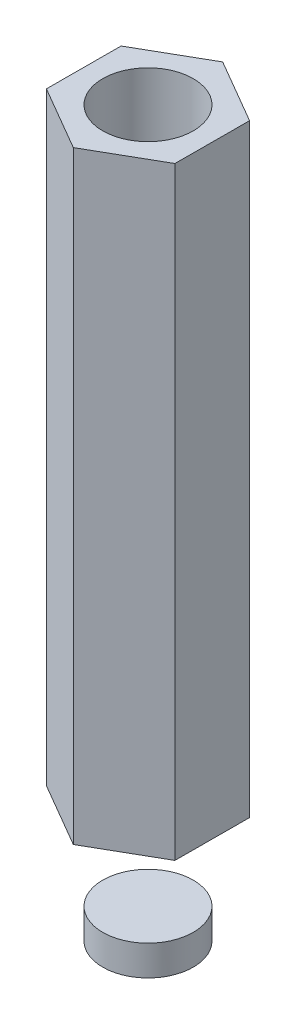
ISO-10303-21;
HEADER;
FILE_DESCRIPTION(('STEP AP214'),'2;1');
FILE_NAME('part.step','',(''),(''),'','','');
FILE_SCHEMA(('AUTOMOTIVE_DESIGN { 1 0 10303 214 1 1 1 1 }'));
ENDSEC;
DATA;
#1=APPLICATION_CONTEXT('core data for automotive mechanical design processes');
#2=APPLICATION_PROTOCOL_DEFINITION('international standard','automotive_design',2000,#1);
#3=PRODUCT_CONTEXT('',#1,'mechanical');
#4=PRODUCT('Part','Part','',(#3));
#5=PRODUCT_RELATED_PRODUCT_CATEGORY('part','',(#4));
#6=PRODUCT_DEFINITION_FORMATION('','',#4);
#7=PRODUCT_DEFINITION_CONTEXT('part definition',#1,'design');
#8=PRODUCT_DEFINITION('design','',#6,#7);
#9=PRODUCT_DEFINITION_SHAPE('','',#8);
#10=(LENGTH_UNIT() NAMED_UNIT(*) SI_UNIT(.MILLI.,.METRE.));
#11=(NAMED_UNIT(*) PLANE_ANGLE_UNIT() SI_UNIT($,.RADIAN.));
#12=(NAMED_UNIT(*) SI_UNIT($,.STERADIAN.) SOLID_ANGLE_UNIT());
#13=UNCERTAINTY_MEASURE_WITH_UNIT(LENGTH_MEASURE(1.E-05),#10,'distance_accuracy_value','');
#14=(GEOMETRIC_REPRESENTATION_CONTEXT(3) GLOBAL_UNCERTAINTY_ASSIGNED_CONTEXT((#13)) GLOBAL_UNIT_ASSIGNED_CONTEXT((#10,
#11,#12)) REPRESENTATION_CONTEXT('',''));
#15=CARTESIAN_POINT('',(0.,0.,0.));
#16=DIRECTION('',(0.,0.,1.));
#17=DIRECTION('',(1.,0.,0.));
#18=AXIS2_PLACEMENT_3D('',#15,#16,#17);
#19=CARTESIAN_POINT('',(0.,1.,0.));
#20=DIRECTION('',(0.,1.,0.));
#21=DIRECTION('',(-1.,0.,0.));
#22=AXIS2_PLACEMENT_3D('',#19,#20,#21);
#23=PLANE('',#22);
#24=CARTESIAN_POINT('',(0.,1.,0.));
#25=DIRECTION('',(0.,1.,0.));
#26=DIRECTION('',(-1.,0.,0.));
#27=AXIS2_PLACEMENT_3D('',#24,#25,#26);
#28=CIRCLE('',#27,1.5);
#29=CARTESIAN_POINT('',(-1.5,0.999999999999999,0.));
#30=VERTEX_POINT('',#29);
#31=EDGE_CURVE('E41',#30,#30,#28,.T.);
#32=ORIENTED_EDGE('',*,*,#31,.T.);
#33=EDGE_LOOP('',(#32));
#34=FACE_BOUND('',#33,.T.);
#35=ADVANCED_FACE('F38',(#34),#23,.T.);
#36=CARTESIAN_POINT('',(0.,0.,0.));
#37=DIRECTION('',(0.,1.,0.));
#38=DIRECTION('',(0.,0.,1.));
#39=AXIS2_PLACEMENT_3D('',#36,#37,#38);
#40=PLANE('',#39);
#41=CARTESIAN_POINT('',(0.,0.,0.));
#42=DIRECTION('',(0.,1.,0.));
#43=DIRECTION('',(0.,0.,1.));
#44=AXIS2_PLACEMENT_3D('',#41,#42,#43);
#45=CIRCLE('',#44,1.5);
#46=CARTESIAN_POINT('',(0.,0.,1.5));
#47=VERTEX_POINT('',#46);
#48=EDGE_CURVE('E11',#47,#47,#45,.T.);
#49=ORIENTED_EDGE('',*,*,#48,.F.);
#50=EDGE_LOOP('',(#49));
#51=FACE_BOUND('',#50,.T.);
#52=ADVANCED_FACE('F53',(#51),#40,.F.);
#53=CARTESIAN_POINT('',(0.,4.,0.));
#54=DIRECTION('',(0.,-1.,0.));
#55=DIRECTION('',(0.,0.,-1.));
#56=AXIS2_PLACEMENT_3D('',#53,#54,#55);
#57=CYLINDRICAL_SURFACE('',#56,1.5);
#58=ORIENTED_EDGE('',*,*,#48,.T.);
#59=EDGE_LOOP('',(#58));
#60=FACE_BOUND('',#59,.T.);
#61=ORIENTED_EDGE('',*,*,#31,.F.);
#62=EDGE_LOOP('',(#61));
#63=FACE_BOUND('',#62,.T.);
#64=ADVANCED_FACE('F51',(#60,#63),#57,.T.);
#65=CLOSED_SHELL('',(#35,#52,#64));
#66=MANIFOLD_SOLID_BREP('B2',#65);
#67=CARTESIAN_POINT('',(-2.13186599078324,4.,-1.24023650407198));
#68=DIRECTION('',(0.,1.,0.));
#69=DIRECTION('',(0.,0.,1.));
#70=AXIS2_PLACEMENT_3D('',#67,#68,#69);
#71=PLANE('',#70);
#72=DIRECTION('',(-0.867671547723485,0.,0.497137893618191));
#73=VECTOR('',#72,1.);
#74=CARTESIAN_POINT('',(0.00814332383552204,4.,-2.46636835751836));
#75=LINE('',#74,#73);
#76=CARTESIAN_POINT('',(0.00814332383552204,4.,-2.46636835751836));
#77=VERTEX_POINT('',#76);
#78=CARTESIAN_POINT('',(-2.13186599078324,4.,-1.24023650407198));
#79=VERTEX_POINT('',#78);
#80=EDGE_CURVE('E163',#77,#79,#75,.T.);
#81=ORIENTED_EDGE('',*,*,#80,.F.);
#82=DIRECTION('',(-0.864369818918982,0.,-0.502856655660404));
#83=VECTOR('',#82,1.);
#84=CARTESIAN_POINT('',(2.14000931461876,4.,-1.22613185344637));
#85=LINE('',#84,#83);
#86=CARTESIAN_POINT('',(2.14000931461876,4.,-1.22613185344637));
#87=VERTEX_POINT('',#86);
#88=EDGE_CURVE('E124',#87,#77,#85,.T.);
#89=ORIENTED_EDGE('',*,*,#88,.F.);
#90=DIRECTION('',(0.00330172880450263,0.,-0.999994549278596));
#91=VECTOR('',#90,1.);
#92=CARTESIAN_POINT('',(2.13186599078323,4.,1.24023650407198));
#93=LINE('',#92,#91);
#94=CARTESIAN_POINT('',(2.13186599078323,4.,1.24023650407198));
#95=VERTEX_POINT('',#94);
#96=EDGE_CURVE('E118',#95,#87,#93,.T.);
#97=ORIENTED_EDGE('',*,*,#96,.F.);
#98=DIRECTION('',(0.867671547723485,0.,-0.497137893618191));
#99=VECTOR('',#98,1.);
#100=CARTESIAN_POINT('',(-0.00814332383552226,4.,2.46636835751835));
#101=LINE('',#100,#99);
#102=CARTESIAN_POINT('',(-0.00814332383552226,4.,2.46636835751835));
#103=VERTEX_POINT('',#102);
#104=EDGE_CURVE('E153',#103,#95,#101,.T.);
#105=ORIENTED_EDGE('',*,*,#104,.F.);
#106=DIRECTION('',(0.864369818918982,0.,0.502856655660404));
#107=VECTOR('',#106,1.);
#108=CARTESIAN_POINT('',(-2.14000931461876,4.,1.22613185344637));
#109=LINE('',#108,#107);
#110=CARTESIAN_POINT('',(-2.14000931461876,4.,1.22613185344637));
#111=VERTEX_POINT('',#110);
#112=EDGE_CURVE('E169',#111,#103,#109,.T.);
#113=ORIENTED_EDGE('',*,*,#112,.F.);
#114=DIRECTION('',(-0.0033017288045028,0.,0.999994549278596));
#115=VECTOR('',#114,1.);
#116=CARTESIAN_POINT('',(-2.13186599078324,4.,-1.24023650407198));
#117=LINE('',#116,#115);
#118=EDGE_CURVE('E166',#79,#111,#117,.T.);
#119=ORIENTED_EDGE('',*,*,#118,.F.);
#120=EDGE_LOOP('',(#81,#89,#97,#105,#113,#119));
#121=FACE_BOUND('',#120,.T.);
#122=ADVANCED_FACE('F78',(#121),#71,.F.);
#123=CARTESIAN_POINT('',(0.00814332383552204,24.,-2.46636835751836));
#124=DIRECTION('',(0.497137893618191,0.,0.867671547723485));
#125=DIRECTION('',(0.867671547723485,0.,-0.497137893618191));
#126=AXIS2_PLACEMENT_3D('',#123,#124,#125);
#127=PLANE('',#126);
#128=ORIENTED_EDGE('',*,*,#80,.T.);
#129=DIRECTION('',(0.,-1.,0.));
#130=VECTOR('',#129,1.);
#131=CARTESIAN_POINT('',(-2.13186599078324,24.,-1.24023650407198));
#132=LINE('',#131,#130);
#133=CARTESIAN_POINT('',(-2.13186599078324,24.,-1.24023650407198));
#134=VERTEX_POINT('',#133);
#135=EDGE_CURVE('E36',#134,#79,#132,.T.);
#136=ORIENTED_EDGE('',*,*,#135,.F.);
#137=DIRECTION('',(-0.867671547723485,0.,0.497137893618191));
#138=VECTOR('',#137,1.);
#139=CARTESIAN_POINT('',(0.00814332383552204,24.,-2.46636835751836));
#140=LINE('',#139,#138);
#141=CARTESIAN_POINT('',(0.00814332383552204,24.,-2.46636835751836));
#142=VERTEX_POINT('',#141);
#143=EDGE_CURVE('E174',#142,#134,#140,.T.);
#144=ORIENTED_EDGE('',*,*,#143,.F.);
#145=DIRECTION('',(0.,-1.,0.));
#146=VECTOR('',#145,1.);
#147=CARTESIAN_POINT('',(0.00814332383552204,24.,-2.46636835751836));
#148=LINE('',#147,#146);
#149=EDGE_CURVE('E159',#142,#77,#148,.T.);
#150=ORIENTED_EDGE('',*,*,#149,.T.);
#151=EDGE_LOOP('',(#128,#136,#144,#150));
#152=FACE_BOUND('',#151,.T.);
#153=ADVANCED_FACE('F80',(#152),#127,.F.);
#154=CARTESIAN_POINT('',(-2.13186599078324,24.,-1.24023650407198));
#155=DIRECTION('',(0.999994549278596,0.,0.0033017288045028));
#156=DIRECTION('',(0.0033017288045028,0.,-0.999994549278596));
#157=AXIS2_PLACEMENT_3D('',#154,#155,#156);
#158=PLANE('',#157);
#159=ORIENTED_EDGE('',*,*,#118,.T.);
#160=DIRECTION('',(0.,-1.,0.));
#161=VECTOR('',#160,1.);
#162=CARTESIAN_POINT('',(-2.14000931461876,24.,1.22613185344637));
#163=LINE('',#162,#161);
#164=CARTESIAN_POINT('',(-2.14000931461876,24.,1.22613185344637));
#165=VERTEX_POINT('',#164);
#166=EDGE_CURVE('E87',#165,#111,#163,.T.);
#167=ORIENTED_EDGE('',*,*,#166,.F.);
#168=DIRECTION('',(-0.0033017288045028,0.,0.999994549278596));
#169=VECTOR('',#168,1.);
#170=CARTESIAN_POINT('',(-2.13186599078324,24.,-1.24023650407198));
#171=LINE('',#170,#169);
#172=EDGE_CURVE('E132',#134,#165,#171,.T.);
#173=ORIENTED_EDGE('',*,*,#172,.F.);
#174=ORIENTED_EDGE('',*,*,#135,.T.);
#175=EDGE_LOOP('',(#159,#167,#173,#174));
#176=FACE_BOUND('',#175,.T.);
#177=ADVANCED_FACE('F202',(#176),#158,.F.);
#178=CARTESIAN_POINT('',(-2.14000931461876,24.,1.22613185344637));
#179=DIRECTION('',(0.502856655660404,0.,-0.864369818918982));
#180=DIRECTION('',(-0.864369818918982,0.,-0.502856655660404));
#181=AXIS2_PLACEMENT_3D('',#178,#179,#180);
#182=PLANE('',#181);
#183=ORIENTED_EDGE('',*,*,#112,.T.);
#184=DIRECTION('',(0.,-1.,0.));
#185=VECTOR('',#184,1.);
#186=CARTESIAN_POINT('',(-0.00814332383552226,24.,2.46636835751835));
#187=LINE('',#186,#185);
#188=CARTESIAN_POINT('',(-0.00814332383552226,24.,2.46636835751835));
#189=VERTEX_POINT('',#188);
#190=EDGE_CURVE('E154',#189,#103,#187,.T.);
#191=ORIENTED_EDGE('',*,*,#190,.F.);
#192=DIRECTION('',(0.864369818918982,0.,0.502856655660404));
#193=VECTOR('',#192,1.);
#194=CARTESIAN_POINT('',(-2.14000931461876,24.,1.22613185344637));
#195=LINE('',#194,#193);
#196=EDGE_CURVE('E145',#165,#189,#195,.T.);
#197=ORIENTED_EDGE('',*,*,#196,.F.);
#198=ORIENTED_EDGE('',*,*,#166,.T.);
#199=EDGE_LOOP('',(#183,#191,#197,#198));
#200=FACE_BOUND('',#199,.T.);
#201=ADVANCED_FACE('F180',(#200),#182,.F.);
#202=CARTESIAN_POINT('',(-0.00814332383552226,24.,2.46636835751835));
#203=DIRECTION('',(-0.497137893618191,0.,-0.867671547723485));
#204=DIRECTION('',(-0.867671547723485,0.,0.497137893618191));
#205=AXIS2_PLACEMENT_3D('',#202,#203,#204);
#206=PLANE('',#205);
#207=ORIENTED_EDGE('',*,*,#104,.T.);
#208=DIRECTION('',(0.,-1.,0.));
#209=VECTOR('',#208,1.);
#210=CARTESIAN_POINT('',(2.13186599078323,24.,1.24023650407198));
#211=LINE('',#210,#209);
#212=CARTESIAN_POINT('',(2.13186599078323,24.,1.24023650407198));
#213=VERTEX_POINT('',#212);
#214=EDGE_CURVE('E150',#213,#95,#211,.T.);
#215=ORIENTED_EDGE('',*,*,#214,.F.);
#216=DIRECTION('',(0.867671547723485,0.,-0.497137893618191));
#217=VECTOR('',#216,1.);
#218=CARTESIAN_POINT('',(-0.00814332383552226,24.,2.46636835751835));
#219=LINE('',#218,#217);
#220=EDGE_CURVE('E139',#189,#213,#219,.T.);
#221=ORIENTED_EDGE('',*,*,#220,.F.);
#222=ORIENTED_EDGE('',*,*,#190,.T.);
#223=EDGE_LOOP('',(#207,#215,#221,#222));
#224=FACE_BOUND('',#223,.T.);
#225=ADVANCED_FACE('F151',(#224),#206,.F.);
#226=CARTESIAN_POINT('',(2.13186599078323,24.,1.24023650407198));
#227=DIRECTION('',(-0.999994549278596,0.,-0.00330172880450263));
#228=DIRECTION('',(-0.00330172880450263,0.,0.999994549278596));
#229=AXIS2_PLACEMENT_3D('',#226,#227,#228);
#230=PLANE('',#229);
#231=ORIENTED_EDGE('',*,*,#96,.T.);
#232=DIRECTION('',(0.,-1.,0.));
#233=VECTOR('',#232,1.);
#234=CARTESIAN_POINT('',(2.14000931461876,24.,-1.22613185344637));
#235=LINE('',#234,#233);
#236=CARTESIAN_POINT('',(2.14000931461876,24.,-1.22613185344637));
#237=VERTEX_POINT('',#236);
#238=EDGE_CURVE('E155',#237,#87,#235,.T.);
#239=ORIENTED_EDGE('',*,*,#238,.F.);
#240=DIRECTION('',(0.00330172880450263,0.,-0.999994549278596));
#241=VECTOR('',#240,1.);
#242=CARTESIAN_POINT('',(2.13186599078323,24.,1.24023650407198));
#243=LINE('',#242,#241);
#244=EDGE_CURVE('E143',#213,#237,#243,.T.);
#245=ORIENTED_EDGE('',*,*,#244,.F.);
#246=ORIENTED_EDGE('',*,*,#214,.T.);
#247=EDGE_LOOP('',(#231,#239,#245,#246));
#248=FACE_BOUND('',#247,.T.);
#249=ADVANCED_FACE('F157',(#248),#230,.F.);
#250=CARTESIAN_POINT('',(2.14000931461876,24.,-1.22613185344637));
#251=DIRECTION('',(-0.502856655660405,0.,0.864369818918982));
#252=DIRECTION('',(0.864369818918982,0.,0.502856655660405));
#253=AXIS2_PLACEMENT_3D('',#250,#251,#252);
#254=PLANE('',#253);
#255=ORIENTED_EDGE('',*,*,#88,.T.);
#256=ORIENTED_EDGE('',*,*,#149,.F.);
#257=DIRECTION('',(-0.864369818918982,0.,-0.502856655660404));
#258=VECTOR('',#257,1.);
#259=CARTESIAN_POINT('',(2.14000931461876,24.,-1.22613185344637));
#260=LINE('',#259,#258);
#261=EDGE_CURVE('E95',#237,#142,#260,.T.);
#262=ORIENTED_EDGE('',*,*,#261,.F.);
#263=ORIENTED_EDGE('',*,*,#238,.T.);
#264=EDGE_LOOP('',(#255,#256,#262,#263));
#265=FACE_BOUND('',#264,.T.);
#266=ADVANCED_FACE('F186',(#265),#254,.F.);
#267=CARTESIAN_POINT('',(-2.13186599078324,24.,-1.24023650407198));
#268=DIRECTION('',(0.,1.,0.));
#269=DIRECTION('',(0.,0.,1.));
#270=AXIS2_PLACEMENT_3D('',#267,#268,#269);
#271=PLANE('',#270);
#272=CARTESIAN_POINT('',(0.,24.,0.));
#273=DIRECTION('',(0.,1.,0.));
#274=DIRECTION('',(0.,0.,1.));
#275=AXIS2_PLACEMENT_3D('',#272,#273,#274);
#276=CIRCLE('',#275,1.5);
#277=CARTESIAN_POINT('',(0.,24.,1.5));
#278=VERTEX_POINT('',#277);
#279=EDGE_CURVE('E214',#278,#278,#276,.T.);
#280=ORIENTED_EDGE('',*,*,#279,.F.);
#281=EDGE_LOOP('',(#280));
#282=FACE_BOUND('',#281,.T.);
#283=ORIENTED_EDGE('',*,*,#143,.T.);
#284=ORIENTED_EDGE('',*,*,#172,.T.);
#285=ORIENTED_EDGE('',*,*,#196,.T.);
#286=ORIENTED_EDGE('',*,*,#220,.T.);
#287=ORIENTED_EDGE('',*,*,#244,.T.);
#288=ORIENTED_EDGE('',*,*,#261,.T.);
#289=EDGE_LOOP('',(#283,#284,#285,#286,#287,#288));
#290=FACE_BOUND('',#289,.T.);
#291=ADVANCED_FACE('F141',(#282,#290),#271,.T.);
#292=CARTESIAN_POINT('',(0.,20.,0.));
#293=DIRECTION('',(0.,1.,0.));
#294=DIRECTION('',(0.,0.,1.));
#295=AXIS2_PLACEMENT_3D('',#292,#293,#294);
#296=CYLINDRICAL_SURFACE('',#295,1.5);
#297=CARTESIAN_POINT('',(0.,20.,0.));
#298=DIRECTION('',(0.,1.,0.));
#299=DIRECTION('',(0.,0.,1.));
#300=AXIS2_PLACEMENT_3D('',#297,#298,#299);
#301=CIRCLE('',#300,1.5);
#302=CARTESIAN_POINT('',(0.,20.,1.5));
#303=VERTEX_POINT('',#302);
#304=EDGE_CURVE('E167',#303,#303,#301,.T.);
#305=ORIENTED_EDGE('',*,*,#304,.F.);
#306=EDGE_LOOP('',(#305));
#307=FACE_BOUND('',#306,.T.);
#308=ORIENTED_EDGE('',*,*,#279,.T.);
#309=EDGE_LOOP('',(#308));
#310=FACE_BOUND('',#309,.T.);
#311=ADVANCED_FACE('F193',(#307,#310),#296,.F.);
#312=CARTESIAN_POINT('',(0.,20.,0.));
#313=DIRECTION('',(0.,1.,0.));
#314=DIRECTION('',(0.,0.,1.));
#315=AXIS2_PLACEMENT_3D('',#312,#313,#314);
#316=PLANE('',#315);
#317=ORIENTED_EDGE('',*,*,#304,.T.);
#318=EDGE_LOOP('',(#317));
#319=FACE_BOUND('',#318,.T.);
#320=ADVANCED_FACE('F206',(#319),#316,.T.);
#321=CLOSED_SHELL('',(#122,#153,#177,#201,#225,#249,#266,#291,#311,#320));
#322=MANIFOLD_SOLID_BREP('B6',#321);
#323=ADVANCED_BREP_SHAPE_REPRESENTATION('',(#18,#66,#322),#14);
#324=SHAPE_DEFINITION_REPRESENTATION(#9,#323);
ENDSEC;
END-ISO-10303-21;
